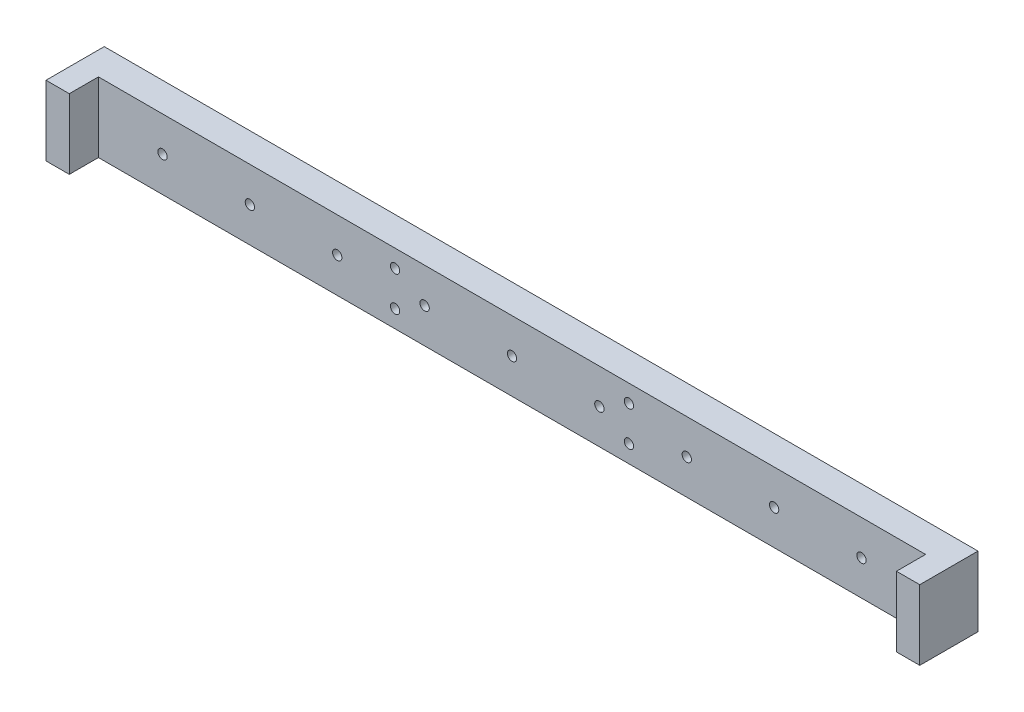
ISO-10303-21;
HEADER;
FILE_DESCRIPTION(('STEP AP214'),'2;1');
FILE_NAME('part.step','',(''),(''),'','','');
FILE_SCHEMA(('AUTOMOTIVE_DESIGN { 1 0 10303 214 1 1 1 1 }'));
ENDSEC;
DATA;
#1=APPLICATION_CONTEXT('core data for automotive mechanical design processes');
#2=APPLICATION_PROTOCOL_DEFINITION('international standard','automotive_design',2000,#1);
#3=PRODUCT_CONTEXT('',#1,'mechanical');
#4=PRODUCT('Part','Part','',(#3));
#5=PRODUCT_RELATED_PRODUCT_CATEGORY('part','',(#4));
#6=PRODUCT_DEFINITION_FORMATION('','',#4);
#7=PRODUCT_DEFINITION_CONTEXT('part definition',#1,'design');
#8=PRODUCT_DEFINITION('design','',#6,#7);
#9=PRODUCT_DEFINITION_SHAPE('','',#8);
#10=(LENGTH_UNIT() NAMED_UNIT(*) SI_UNIT(.MILLI.,.METRE.));
#11=(NAMED_UNIT(*) PLANE_ANGLE_UNIT() SI_UNIT($,.RADIAN.));
#12=(NAMED_UNIT(*) SI_UNIT($,.STERADIAN.) SOLID_ANGLE_UNIT());
#13=UNCERTAINTY_MEASURE_WITH_UNIT(LENGTH_MEASURE(1.E-05),#10,'distance_accuracy_value','');
#14=(GEOMETRIC_REPRESENTATION_CONTEXT(3) GLOBAL_UNCERTAINTY_ASSIGNED_CONTEXT((#13)) GLOBAL_UNIT_ASSIGNED_CONTEXT((#10,
#11,#12)) REPRESENTATION_CONTEXT('',''));
#15=CARTESIAN_POINT('',(0.,0.,0.));
#16=DIRECTION('',(0.,0.,1.));
#17=DIRECTION('',(1.,0.,0.));
#18=AXIS2_PLACEMENT_3D('',#15,#16,#17);
#19=CARTESIAN_POINT('',(-75.,-6.00000000000001,5.));
#20=DIRECTION('',(1.,0.,0.));
#21=DIRECTION('',(0.,0.,-1.));
#22=AXIS2_PLACEMENT_3D('',#19,#20,#21);
#23=PLANE('',#22);
#24=DIRECTION('',(0.,-1.,0.));
#25=VECTOR('',#24,1.);
#26=CARTESIAN_POINT('',(-75.,-6.00000000000001,0.));
#27=LINE('',#26,#25);
#28=CARTESIAN_POINT('',(-75.,5.99999999999999,0.));
#29=VERTEX_POINT('',#28);
#30=CARTESIAN_POINT('',(-75.,-6.00000000000001,0.));
#31=VERTEX_POINT('',#30);
#32=EDGE_CURVE('E177',#29,#31,#27,.T.);
#33=ORIENTED_EDGE('',*,*,#32,.T.);
#34=DIRECTION('',(0.,0.,-1.));
#35=VECTOR('',#34,1.);
#36=CARTESIAN_POINT('',(-75.,-6.00000000000001,5.));
#37=LINE('',#36,#35);
#38=CARTESIAN_POINT('',(-75.,-6.00000000000001,10.));
#39=VERTEX_POINT('',#38);
#40=EDGE_CURVE('E11',#39,#31,#37,.T.);
#41=ORIENTED_EDGE('',*,*,#40,.F.);
#42=DIRECTION('',(0.,-1.,0.));
#43=VECTOR('',#42,1.);
#44=CARTESIAN_POINT('',(-75.,-6.00000000000001,10.));
#45=LINE('',#44,#43);
#46=CARTESIAN_POINT('',(-75.,5.99999999999999,10.));
#47=VERTEX_POINT('',#46);
#48=EDGE_CURVE('E152',#47,#39,#45,.T.);
#49=ORIENTED_EDGE('',*,*,#48,.F.);
#50=DIRECTION('',(0.,0.,-1.));
#51=VECTOR('',#50,1.);
#52=CARTESIAN_POINT('',(-75.,5.99999999999999,5.));
#53=LINE('',#52,#51);
#54=EDGE_CURVE('E119',#47,#29,#53,.T.);
#55=ORIENTED_EDGE('',*,*,#54,.T.);
#56=EDGE_LOOP('',(#33,#41,#49,#55));
#57=FACE_BOUND('',#56,.T.);
#58=ADVANCED_FACE('F43',(#57),#23,.F.);
#59=CARTESIAN_POINT('',(75.,-5.99999999999999,5.));
#60=DIRECTION('',(0.,1.,0.));
#61=DIRECTION('',(-1.,0.,0.));
#62=AXIS2_PLACEMENT_3D('',#59,#60,#61);
#63=PLANE('',#62);
#64=DIRECTION('',(1.,0.,0.));
#65=VECTOR('',#64,1.);
#66=CARTESIAN_POINT('',(75.,-5.99999999999999,0.));
#67=LINE('',#66,#65);
#68=CARTESIAN_POINT('',(75.,-5.99999999999999,0.));
#69=VERTEX_POINT('',#68);
#70=EDGE_CURVE('E187',#31,#69,#67,.T.);
#71=ORIENTED_EDGE('',*,*,#70,.T.);
#72=DIRECTION('',(0.,0.,-1.));
#73=VECTOR('',#72,1.);
#74=CARTESIAN_POINT('',(75.,-5.99999999999999,5.));
#75=LINE('',#74,#73);
#76=CARTESIAN_POINT('',(75.,-6.00000000000001,10.));
#77=VERTEX_POINT('',#76);
#78=EDGE_CURVE('E51',#77,#69,#75,.T.);
#79=ORIENTED_EDGE('',*,*,#78,.F.);
#80=DIRECTION('',(-1.,0.,0.));
#81=VECTOR('',#80,1.);
#82=CARTESIAN_POINT('',(71.,-6.00000000000001,10.));
#83=LINE('',#82,#81);
#84=CARTESIAN_POINT('',(71.,-6.00000000000001,10.));
#85=VERTEX_POINT('',#84);
#86=EDGE_CURVE('E128',#77,#85,#83,.T.);
#87=ORIENTED_EDGE('',*,*,#86,.T.);
#88=DIRECTION('',(0.,0.,-1.));
#89=VECTOR('',#88,1.);
#90=CARTESIAN_POINT('',(71.,-6.00000000000001,10.));
#91=LINE('',#90,#89);
#92=CARTESIAN_POINT('',(71.,-5.99999999999999,5.));
#93=VERTEX_POINT('',#92);
#94=EDGE_CURVE('E143',#85,#93,#91,.T.);
#95=ORIENTED_EDGE('',*,*,#94,.T.);
#96=DIRECTION('',(1.,0.,0.));
#97=VECTOR('',#96,1.);
#98=CARTESIAN_POINT('',(75.,-5.99999999999999,5.));
#99=LINE('',#98,#97);
#100=CARTESIAN_POINT('',(-71.,-6.00000000000001,5.));
#101=VERTEX_POINT('',#100);
#102=EDGE_CURVE('E63',#101,#93,#99,.T.);
#103=ORIENTED_EDGE('',*,*,#102,.F.);
#104=DIRECTION('',(0.,0.,-1.));
#105=VECTOR('',#104,1.);
#106=CARTESIAN_POINT('',(-71.,-6.00000000000001,10.));
#107=LINE('',#106,#105);
#108=CARTESIAN_POINT('',(-71.,-6.00000000000001,10.));
#109=VERTEX_POINT('',#108);
#110=EDGE_CURVE('E173',#109,#101,#107,.T.);
#111=ORIENTED_EDGE('',*,*,#110,.F.);
#112=DIRECTION('',(1.,0.,0.));
#113=VECTOR('',#112,1.);
#114=CARTESIAN_POINT('',(-71.,-6.00000000000001,10.));
#115=LINE('',#114,#113);
#116=EDGE_CURVE('E156',#39,#109,#115,.T.);
#117=ORIENTED_EDGE('',*,*,#116,.F.);
#118=ORIENTED_EDGE('',*,*,#40,.T.);
#119=EDGE_LOOP('',(#71,#79,#87,#95,#103,#111,#117,#118));
#120=FACE_BOUND('',#119,.T.);
#121=ADVANCED_FACE('F213',(#120),#63,.F.);
#122=CARTESIAN_POINT('',(75.,-5.99999999999999,5.));
#123=DIRECTION('',(-1.,0.,0.));
#124=DIRECTION('',(0.,0.,1.));
#125=AXIS2_PLACEMENT_3D('',#122,#123,#124);
#126=PLANE('',#125);
#127=DIRECTION('',(0.,1.,0.));
#128=VECTOR('',#127,1.);
#129=CARTESIAN_POINT('',(75.,-5.99999999999999,0.));
#130=LINE('',#129,#128);
#131=CARTESIAN_POINT('',(75.,6.00000000000001,0.));
#132=VERTEX_POINT('',#131);
#133=EDGE_CURVE('E114',#69,#132,#130,.T.);
#134=ORIENTED_EDGE('',*,*,#133,.T.);
#135=DIRECTION('',(0.,0.,-1.));
#136=VECTOR('',#135,1.);
#137=CARTESIAN_POINT('',(75.,6.00000000000001,5.));
#138=LINE('',#137,#136);
#139=CARTESIAN_POINT('',(75.,5.99999999999999,10.));
#140=VERTEX_POINT('',#139);
#141=EDGE_CURVE('E107',#140,#132,#138,.T.);
#142=ORIENTED_EDGE('',*,*,#141,.F.);
#143=DIRECTION('',(0.,-1.,0.));
#144=VECTOR('',#143,1.);
#145=CARTESIAN_POINT('',(75.,-6.00000000000001,10.));
#146=LINE('',#145,#144);
#147=EDGE_CURVE('E111',#140,#77,#146,.T.);
#148=ORIENTED_EDGE('',*,*,#147,.T.);
#149=ORIENTED_EDGE('',*,*,#78,.T.);
#150=EDGE_LOOP('',(#134,#142,#148,#149));
#151=FACE_BOUND('',#150,.T.);
#152=ADVANCED_FACE('F109',(#151),#126,.F.);
#153=CARTESIAN_POINT('',(75.,6.00000000000001,5.));
#154=DIRECTION('',(0.,-1.,0.));
#155=DIRECTION('',(1.,0.,0.));
#156=AXIS2_PLACEMENT_3D('',#153,#154,#155);
#157=PLANE('',#156);
#158=DIRECTION('',(-1.,0.,0.));
#159=VECTOR('',#158,1.);
#160=CARTESIAN_POINT('',(75.,6.00000000000001,0.));
#161=LINE('',#160,#159);
#162=EDGE_CURVE('E181',#132,#29,#161,.T.);
#163=ORIENTED_EDGE('',*,*,#162,.T.);
#164=ORIENTED_EDGE('',*,*,#54,.F.);
#165=DIRECTION('',(-1.,0.,0.));
#166=VECTOR('',#165,1.);
#167=CARTESIAN_POINT('',(-75.,5.99999999999999,10.));
#168=LINE('',#167,#166);
#169=CARTESIAN_POINT('',(-71.,6.00000000000001,10.));
#170=VERTEX_POINT('',#169);
#171=EDGE_CURVE('E162',#170,#47,#168,.T.);
#172=ORIENTED_EDGE('',*,*,#171,.F.);
#173=DIRECTION('',(0.,0.,-1.));
#174=VECTOR('',#173,1.);
#175=CARTESIAN_POINT('',(-71.,6.00000000000001,10.));
#176=LINE('',#175,#174);
#177=CARTESIAN_POINT('',(-71.,6.00000000000001,5.));
#178=VERTEX_POINT('',#177);
#179=EDGE_CURVE('E166',#170,#178,#176,.T.);
#180=ORIENTED_EDGE('',*,*,#179,.T.);
#181=DIRECTION('',(-1.,0.,0.));
#182=VECTOR('',#181,1.);
#183=CARTESIAN_POINT('',(75.,6.00000000000001,5.));
#184=LINE('',#183,#182);
#185=CARTESIAN_POINT('',(71.,6.00000000000001,5.));
#186=VERTEX_POINT('',#185);
#187=EDGE_CURVE('E180',#186,#178,#184,.T.);
#188=ORIENTED_EDGE('',*,*,#187,.F.);
#189=DIRECTION('',(0.,0.,-1.));
#190=VECTOR('',#189,1.);
#191=CARTESIAN_POINT('',(71.,6.00000000000001,10.));
#192=LINE('',#191,#190);
#193=CARTESIAN_POINT('',(71.,6.00000000000001,10.));
#194=VERTEX_POINT('',#193);
#195=EDGE_CURVE('E133',#194,#186,#192,.T.);
#196=ORIENTED_EDGE('',*,*,#195,.F.);
#197=DIRECTION('',(1.,0.,0.));
#198=VECTOR('',#197,1.);
#199=CARTESIAN_POINT('',(75.,5.99999999999999,10.));
#200=LINE('',#199,#198);
#201=EDGE_CURVE('E125',#194,#140,#200,.T.);
#202=ORIENTED_EDGE('',*,*,#201,.T.);
#203=ORIENTED_EDGE('',*,*,#141,.T.);
#204=EDGE_LOOP('',(#163,#164,#172,#180,#188,#196,#202,#203));
#205=FACE_BOUND('',#204,.T.);
#206=ADVANCED_FACE('F131',(#205),#157,.F.);
#207=CARTESIAN_POINT('',(0.,0.,5.));
#208=DIRECTION('',(0.,0.,1.));
#209=DIRECTION('',(1.,0.,0.));
#210=AXIS2_PLACEMENT_3D('',#207,#208,#209);
#211=PLANE('',#210);
#212=CARTESIAN_POINT('',(15.,0.,5.));
#213=DIRECTION('',(0.,0.,1.));
#214=DIRECTION('',(1.,0.,0.));
#215=AXIS2_PLACEMENT_3D('',#212,#213,#214);
#216=CIRCLE('',#215,0.799999999999988);
#217=CARTESIAN_POINT('',(15.8,0.,5.));
#218=VERTEX_POINT('',#217);
#219=EDGE_CURVE('E466',#218,#218,#216,.T.);
#220=ORIENTED_EDGE('',*,*,#219,.F.);
#221=EDGE_LOOP('',(#220));
#222=FACE_BOUND('',#221,.T.);
#223=CARTESIAN_POINT('',(30.,0.,5.));
#224=DIRECTION('',(0.,0.,1.));
#225=DIRECTION('',(1.,0.,0.));
#226=AXIS2_PLACEMENT_3D('',#223,#224,#225);
#227=CIRCLE('',#226,0.799999999999988);
#228=CARTESIAN_POINT('',(30.8,0.,5.));
#229=VERTEX_POINT('',#228);
#230=EDGE_CURVE('E470',#229,#229,#227,.T.);
#231=ORIENTED_EDGE('',*,*,#230,.F.);
#232=EDGE_LOOP('',(#231));
#233=FACE_BOUND('',#232,.T.);
#234=CARTESIAN_POINT('',(-30.,0.,5.));
#235=DIRECTION('',(0.,0.,1.));
#236=DIRECTION('',(1.,0.,0.));
#237=AXIS2_PLACEMENT_3D('',#234,#235,#236);
#238=CIRCLE('',#237,0.799999999999988);
#239=CARTESIAN_POINT('',(-29.2,0.,5.));
#240=VERTEX_POINT('',#239);
#241=EDGE_CURVE('E480',#240,#240,#238,.T.);
#242=ORIENTED_EDGE('',*,*,#241,.F.);
#243=EDGE_LOOP('',(#242));
#244=FACE_BOUND('',#243,.T.);
#245=CARTESIAN_POINT('',(-45.,0.,5.));
#246=DIRECTION('',(0.,0.,1.));
#247=DIRECTION('',(1.,0.,0.));
#248=AXIS2_PLACEMENT_3D('',#245,#246,#247);
#249=CIRCLE('',#248,0.799999999999988);
#250=CARTESIAN_POINT('',(-44.2,0.,5.));
#251=VERTEX_POINT('',#250);
#252=EDGE_CURVE('E488',#251,#251,#249,.T.);
#253=ORIENTED_EDGE('',*,*,#252,.F.);
#254=EDGE_LOOP('',(#253));
#255=FACE_BOUND('',#254,.T.);
#256=CARTESIAN_POINT('',(-60.,0.,5.));
#257=DIRECTION('',(0.,0.,1.));
#258=DIRECTION('',(1.,0.,0.));
#259=AXIS2_PLACEMENT_3D('',#256,#257,#258);
#260=CIRCLE('',#259,0.799999999999988);
#261=CARTESIAN_POINT('',(-59.2,0.,5.));
#262=VERTEX_POINT('',#261);
#263=EDGE_CURVE('E496',#262,#262,#260,.T.);
#264=ORIENTED_EDGE('',*,*,#263,.F.);
#265=EDGE_LOOP('',(#264));
#266=FACE_BOUND('',#265,.T.);
#267=CARTESIAN_POINT('',(-15.,0.,5.));
#268=DIRECTION('',(0.,0.,1.));
#269=DIRECTION('',(1.,0.,0.));
#270=AXIS2_PLACEMENT_3D('',#267,#268,#269);
#271=CIRCLE('',#270,0.799999999999988);
#272=CARTESIAN_POINT('',(-14.2,0.,5.));
#273=VERTEX_POINT('',#272);
#274=EDGE_CURVE('E504',#273,#273,#271,.T.);
#275=ORIENTED_EDGE('',*,*,#274,.F.);
#276=EDGE_LOOP('',(#275));
#277=FACE_BOUND('',#276,.T.);
#278=CARTESIAN_POINT('',(45.,0.,5.));
#279=DIRECTION('',(0.,0.,1.));
#280=DIRECTION('',(1.,0.,0.));
#281=AXIS2_PLACEMENT_3D('',#278,#279,#280);
#282=CIRCLE('',#281,0.799999999999988);
#283=CARTESIAN_POINT('',(45.8,0.,5.));
#284=VERTEX_POINT('',#283);
#285=EDGE_CURVE('E512',#284,#284,#282,.T.);
#286=ORIENTED_EDGE('',*,*,#285,.F.);
#287=EDGE_LOOP('',(#286));
#288=FACE_BOUND('',#287,.T.);
#289=CARTESIAN_POINT('',(60.,0.,5.));
#290=DIRECTION('',(0.,0.,1.));
#291=DIRECTION('',(1.,0.,0.));
#292=AXIS2_PLACEMENT_3D('',#289,#290,#291);
#293=CIRCLE('',#292,0.799999999999988);
#294=CARTESIAN_POINT('',(60.8,0.,5.));
#295=VERTEX_POINT('',#294);
#296=EDGE_CURVE('E520',#295,#295,#293,.T.);
#297=ORIENTED_EDGE('',*,*,#296,.F.);
#298=EDGE_LOOP('',(#297));
#299=FACE_BOUND('',#298,.T.);
#300=CARTESIAN_POINT('',(0.,0.,5.));
#301=DIRECTION('',(0.,0.,1.));
#302=DIRECTION('',(1.,0.,0.));
#303=AXIS2_PLACEMENT_3D('',#300,#301,#302);
#304=CIRCLE('',#303,0.799999999999998);
#305=CARTESIAN_POINT('',(0.799999999999998,0.,5.));
#306=VERTEX_POINT('',#305);
#307=EDGE_CURVE('E532',#306,#306,#304,.T.);
#308=ORIENTED_EDGE('',*,*,#307,.F.);
#309=EDGE_LOOP('',(#308));
#310=FACE_BOUND('',#309,.T.);
#311=CARTESIAN_POINT('',(20.075,-3.,5.));
#312=DIRECTION('',(0.,0.,1.));
#313=DIRECTION('',(1.,0.,0.));
#314=AXIS2_PLACEMENT_3D('',#311,#312,#313);
#315=CIRCLE('',#314,0.799999999999999);
#316=CARTESIAN_POINT('',(20.875,-3.,5.));
#317=VERTEX_POINT('',#316);
#318=EDGE_CURVE('E540',#317,#317,#315,.T.);
#319=ORIENTED_EDGE('',*,*,#318,.F.);
#320=EDGE_LOOP('',(#319));
#321=FACE_BOUND('',#320,.T.);
#322=CARTESIAN_POINT('',(20.075,3.,5.));
#323=DIRECTION('',(0.,0.,1.));
#324=DIRECTION('',(1.,0.,0.));
#325=AXIS2_PLACEMENT_3D('',#322,#323,#324);
#326=CIRCLE('',#325,0.799999999999999);
#327=CARTESIAN_POINT('',(20.875,3.,5.));
#328=VERTEX_POINT('',#327);
#329=EDGE_CURVE('E548',#328,#328,#326,.T.);
#330=ORIENTED_EDGE('',*,*,#329,.F.);
#331=EDGE_LOOP('',(#330));
#332=FACE_BOUND('',#331,.T.);
#333=CARTESIAN_POINT('',(-20.075,-2.99999999999994,5.));
#334=DIRECTION('',(0.,0.,1.));
#335=DIRECTION('',(1.,0.,0.));
#336=AXIS2_PLACEMENT_3D('',#333,#334,#335);
#337=CIRCLE('',#336,0.799999999999999);
#338=CARTESIAN_POINT('',(-19.275,-2.99999999999994,5.));
#339=VERTEX_POINT('',#338);
#340=EDGE_CURVE('E556',#339,#339,#337,.T.);
#341=ORIENTED_EDGE('',*,*,#340,.F.);
#342=EDGE_LOOP('',(#341));
#343=FACE_BOUND('',#342,.T.);
#344=CARTESIAN_POINT('',(-20.075,3.00000000000007,5.));
#345=DIRECTION('',(0.,0.,1.));
#346=DIRECTION('',(1.,0.,0.));
#347=AXIS2_PLACEMENT_3D('',#344,#345,#346);
#348=CIRCLE('',#347,0.799999999999999);
#349=CARTESIAN_POINT('',(-19.275,3.00000000000007,5.));
#350=VERTEX_POINT('',#349);
#351=EDGE_CURVE('E146',#350,#350,#348,.T.);
#352=ORIENTED_EDGE('',*,*,#351,.F.);
#353=EDGE_LOOP('',(#352));
#354=FACE_BOUND('',#353,.T.);
#355=DIRECTION('',(0.,1.,0.));
#356=VECTOR('',#355,1.);
#357=CARTESIAN_POINT('',(71.,6.00000000000001,5.));
#358=LINE('',#357,#356);
#359=EDGE_CURVE('E58',#93,#186,#358,.T.);
#360=ORIENTED_EDGE('',*,*,#359,.T.);
#361=ORIENTED_EDGE('',*,*,#187,.T.);
#362=DIRECTION('',(0.,1.,0.));
#363=VECTOR('',#362,1.);
#364=CARTESIAN_POINT('',(-71.,6.00000000000001,5.));
#365=LINE('',#364,#363);
#366=EDGE_CURVE('E151',#101,#178,#365,.T.);
#367=ORIENTED_EDGE('',*,*,#366,.F.);
#368=ORIENTED_EDGE('',*,*,#102,.T.);
#369=EDGE_LOOP('',(#360,#361,#367,#368));
#370=FACE_BOUND('',#369,.T.);
#371=ADVANCED_FACE('F212',(#222,#233,#244,#255,#266,#277,#288,#299,#310,#321,#332,#343,#354,
#370),#211,.T.);
#372=CARTESIAN_POINT('',(0.,0.,0.));
#373=DIRECTION('',(0.,0.,1.));
#374=DIRECTION('',(1.,0.,0.));
#375=AXIS2_PLACEMENT_3D('',#372,#373,#374);
#376=PLANE('',#375);
#377=CARTESIAN_POINT('',(15.,0.,0.));
#378=DIRECTION('',(0.,0.,1.));
#379=DIRECTION('',(1.,0.,0.));
#380=AXIS2_PLACEMENT_3D('',#377,#378,#379);
#381=CIRCLE('',#380,0.799999999999999);
#382=CARTESIAN_POINT('',(15.8,0.,0.));
#383=VERTEX_POINT('',#382);
#384=EDGE_CURVE('E463',#383,#383,#381,.T.);
#385=ORIENTED_EDGE('',*,*,#384,.T.);
#386=EDGE_LOOP('',(#385));
#387=FACE_BOUND('',#386,.T.);
#388=CARTESIAN_POINT('',(30.,0.,0.));
#389=DIRECTION('',(0.,0.,1.));
#390=DIRECTION('',(1.,0.,0.));
#391=AXIS2_PLACEMENT_3D('',#388,#389,#390);
#392=CIRCLE('',#391,0.799999999999999);
#393=CARTESIAN_POINT('',(30.8,0.,0.));
#394=VERTEX_POINT('',#393);
#395=EDGE_CURVE('E476',#394,#394,#392,.T.);
#396=ORIENTED_EDGE('',*,*,#395,.T.);
#397=EDGE_LOOP('',(#396));
#398=FACE_BOUND('',#397,.T.);
#399=CARTESIAN_POINT('',(-30.,0.,0.));
#400=DIRECTION('',(0.,0.,1.));
#401=DIRECTION('',(1.,0.,0.));
#402=AXIS2_PLACEMENT_3D('',#399,#400,#401);
#403=CIRCLE('',#402,0.799999999999999);
#404=CARTESIAN_POINT('',(-29.2,0.,0.));
#405=VERTEX_POINT('',#404);
#406=EDGE_CURVE('E484',#405,#405,#403,.T.);
#407=ORIENTED_EDGE('',*,*,#406,.T.);
#408=EDGE_LOOP('',(#407));
#409=FACE_BOUND('',#408,.T.);
#410=CARTESIAN_POINT('',(-45.,0.,0.));
#411=DIRECTION('',(0.,0.,1.));
#412=DIRECTION('',(1.,0.,0.));
#413=AXIS2_PLACEMENT_3D('',#410,#411,#412);
#414=CIRCLE('',#413,0.800000000000002);
#415=CARTESIAN_POINT('',(-44.2,0.,0.));
#416=VERTEX_POINT('',#415);
#417=EDGE_CURVE('E492',#416,#416,#414,.T.);
#418=ORIENTED_EDGE('',*,*,#417,.T.);
#419=EDGE_LOOP('',(#418));
#420=FACE_BOUND('',#419,.T.);
#421=CARTESIAN_POINT('',(-60.,0.,0.));
#422=DIRECTION('',(0.,0.,1.));
#423=DIRECTION('',(1.,0.,0.));
#424=AXIS2_PLACEMENT_3D('',#421,#422,#423);
#425=CIRCLE('',#424,0.800000000000002);
#426=CARTESIAN_POINT('',(-59.2,0.,0.));
#427=VERTEX_POINT('',#426);
#428=EDGE_CURVE('E500',#427,#427,#425,.T.);
#429=ORIENTED_EDGE('',*,*,#428,.T.);
#430=EDGE_LOOP('',(#429));
#431=FACE_BOUND('',#430,.T.);
#432=CARTESIAN_POINT('',(-15.,0.,0.));
#433=DIRECTION('',(0.,0.,1.));
#434=DIRECTION('',(1.,0.,0.));
#435=AXIS2_PLACEMENT_3D('',#432,#433,#434);
#436=CIRCLE('',#435,0.799999999999999);
#437=CARTESIAN_POINT('',(-14.2,0.,0.));
#438=VERTEX_POINT('',#437);
#439=EDGE_CURVE('E508',#438,#438,#436,.T.);
#440=ORIENTED_EDGE('',*,*,#439,.T.);
#441=EDGE_LOOP('',(#440));
#442=FACE_BOUND('',#441,.T.);
#443=CARTESIAN_POINT('',(45.,0.,0.));
#444=DIRECTION('',(0.,0.,1.));
#445=DIRECTION('',(1.,0.,0.));
#446=AXIS2_PLACEMENT_3D('',#443,#444,#445);
#447=CIRCLE('',#446,0.800000000000002);
#448=CARTESIAN_POINT('',(45.8,0.,0.));
#449=VERTEX_POINT('',#448);
#450=EDGE_CURVE('E516',#449,#449,#447,.T.);
#451=ORIENTED_EDGE('',*,*,#450,.T.);
#452=EDGE_LOOP('',(#451));
#453=FACE_BOUND('',#452,.T.);
#454=CARTESIAN_POINT('',(60.,0.,0.));
#455=DIRECTION('',(0.,0.,1.));
#456=DIRECTION('',(1.,0.,0.));
#457=AXIS2_PLACEMENT_3D('',#454,#455,#456);
#458=CIRCLE('',#457,0.800000000000002);
#459=CARTESIAN_POINT('',(60.8,0.,0.));
#460=VERTEX_POINT('',#459);
#461=EDGE_CURVE('E524',#460,#460,#458,.T.);
#462=ORIENTED_EDGE('',*,*,#461,.T.);
#463=EDGE_LOOP('',(#462));
#464=FACE_BOUND('',#463,.T.);
#465=CARTESIAN_POINT('',(0.,0.,0.));
#466=DIRECTION('',(0.,0.,-1.));
#467=DIRECTION('',(-1.,0.,0.));
#468=AXIS2_PLACEMENT_3D('',#465,#466,#467);
#469=CIRCLE('',#468,0.799999999999999);
#470=CARTESIAN_POINT('',(-0.799999999999999,0.,0.));
#471=VERTEX_POINT('',#470);
#472=EDGE_CURVE('E528',#471,#471,#469,.T.);
#473=ORIENTED_EDGE('',*,*,#472,.F.);
#474=EDGE_LOOP('',(#473));
#475=FACE_BOUND('',#474,.T.);
#476=CARTESIAN_POINT('',(20.075,-3.,0.));
#477=DIRECTION('',(0.,0.,-1.));
#478=DIRECTION('',(-1.,0.,0.));
#479=AXIS2_PLACEMENT_3D('',#476,#477,#478);
#480=CIRCLE('',#479,0.799999999999999);
#481=CARTESIAN_POINT('',(19.275,-3.,0.));
#482=VERTEX_POINT('',#481);
#483=EDGE_CURVE('E536',#482,#482,#480,.T.);
#484=ORIENTED_EDGE('',*,*,#483,.F.);
#485=EDGE_LOOP('',(#484));
#486=FACE_BOUND('',#485,.T.);
#487=CARTESIAN_POINT('',(20.075,3.,0.));
#488=DIRECTION('',(0.,0.,-1.));
#489=DIRECTION('',(-1.,0.,0.));
#490=AXIS2_PLACEMENT_3D('',#487,#488,#489);
#491=CIRCLE('',#490,0.799999999999999);
#492=CARTESIAN_POINT('',(19.275,3.,0.));
#493=VERTEX_POINT('',#492);
#494=EDGE_CURVE('E544',#493,#493,#491,.T.);
#495=ORIENTED_EDGE('',*,*,#494,.F.);
#496=EDGE_LOOP('',(#495));
#497=FACE_BOUND('',#496,.T.);
#498=CARTESIAN_POINT('',(-20.075,-2.99999999999994,0.));
#499=DIRECTION('',(0.,0.,-1.));
#500=DIRECTION('',(-1.,0.,0.));
#501=AXIS2_PLACEMENT_3D('',#498,#499,#500);
#502=CIRCLE('',#501,0.799999999999999);
#503=CARTESIAN_POINT('',(-20.875,-2.99999999999994,0.));
#504=VERTEX_POINT('',#503);
#505=EDGE_CURVE('E552',#504,#504,#502,.T.);
#506=ORIENTED_EDGE('',*,*,#505,.F.);
#507=EDGE_LOOP('',(#506));
#508=FACE_BOUND('',#507,.T.);
#509=CARTESIAN_POINT('',(-20.075,3.00000000000007,0.));
#510=DIRECTION('',(0.,0.,-1.));
#511=DIRECTION('',(-1.,0.,0.));
#512=AXIS2_PLACEMENT_3D('',#509,#510,#511);
#513=CIRCLE('',#512,0.799999999999999);
#514=CARTESIAN_POINT('',(-20.875,3.00000000000007,0.));
#515=VERTEX_POINT('',#514);
#516=EDGE_CURVE('E560',#515,#515,#513,.T.);
#517=ORIENTED_EDGE('',*,*,#516,.F.);
#518=EDGE_LOOP('',(#517));
#519=FACE_BOUND('',#518,.T.);
#520=ORIENTED_EDGE('',*,*,#32,.F.);
#521=ORIENTED_EDGE('',*,*,#162,.F.);
#522=ORIENTED_EDGE('',*,*,#133,.F.);
#523=ORIENTED_EDGE('',*,*,#70,.F.);
#524=EDGE_LOOP('',(#520,#521,#522,#523));
#525=FACE_BOUND('',#524,.T.);
#526=ADVANCED_FACE('F200',(#387,#398,#409,#420,#431,#442,#453,#464,#475,#486,#497,#508,#519,
#525),#376,.F.);
#527=CARTESIAN_POINT('',(-71.,6.00000000000001,10.));
#528=DIRECTION('',(-1.,0.,0.));
#529=DIRECTION('',(0.,0.,1.));
#530=AXIS2_PLACEMENT_3D('',#527,#528,#529);
#531=PLANE('',#530);
#532=ORIENTED_EDGE('',*,*,#366,.T.);
#533=ORIENTED_EDGE('',*,*,#179,.F.);
#534=DIRECTION('',(0.,1.,0.));
#535=VECTOR('',#534,1.);
#536=CARTESIAN_POINT('',(-71.,6.00000000000001,10.));
#537=LINE('',#536,#535);
#538=EDGE_CURVE('E159',#109,#170,#537,.T.);
#539=ORIENTED_EDGE('',*,*,#538,.F.);
#540=ORIENTED_EDGE('',*,*,#110,.T.);
#541=EDGE_LOOP('',(#532,#533,#539,#540));
#542=FACE_BOUND('',#541,.T.);
#543=ADVANCED_FACE('F211',(#542),#531,.F.);
#544=CARTESIAN_POINT('',(0.,0.,10.));
#545=DIRECTION('',(0.,0.,-1.));
#546=DIRECTION('',(-1.,0.,0.));
#547=AXIS2_PLACEMENT_3D('',#544,#545,#546);
#548=PLANE('',#547);
#549=ORIENTED_EDGE('',*,*,#48,.T.);
#550=ORIENTED_EDGE('',*,*,#116,.T.);
#551=ORIENTED_EDGE('',*,*,#538,.T.);
#552=ORIENTED_EDGE('',*,*,#171,.T.);
#553=EDGE_LOOP('',(#549,#550,#551,#552));
#554=FACE_BOUND('',#553,.T.);
#555=ADVANCED_FACE('F206',(#554),#548,.F.);
#556=CARTESIAN_POINT('',(71.,6.00000000000001,10.));
#557=DIRECTION('',(-1.,0.,0.));
#558=DIRECTION('',(0.,0.,1.));
#559=AXIS2_PLACEMENT_3D('',#556,#557,#558);
#560=PLANE('',#559);
#561=ORIENTED_EDGE('',*,*,#359,.F.);
#562=ORIENTED_EDGE('',*,*,#94,.F.);
#563=DIRECTION('',(0.,1.,0.));
#564=VECTOR('',#563,1.);
#565=CARTESIAN_POINT('',(71.,6.00000000000001,10.));
#566=LINE('',#565,#564);
#567=EDGE_CURVE('E135',#85,#194,#566,.T.);
#568=ORIENTED_EDGE('',*,*,#567,.T.);
#569=ORIENTED_EDGE('',*,*,#195,.T.);
#570=EDGE_LOOP('',(#561,#562,#568,#569));
#571=FACE_BOUND('',#570,.T.);
#572=ADVANCED_FACE('F215',(#571),#560,.T.);
#573=CARTESIAN_POINT('',(0.,0.,10.));
#574=DIRECTION('',(0.,0.,-1.));
#575=DIRECTION('',(1.,0.,0.));
#576=AXIS2_PLACEMENT_3D('',#573,#574,#575);
#577=PLANE('',#576);
#578=ORIENTED_EDGE('',*,*,#147,.F.);
#579=ORIENTED_EDGE('',*,*,#201,.F.);
#580=ORIENTED_EDGE('',*,*,#567,.F.);
#581=ORIENTED_EDGE('',*,*,#86,.F.);
#582=EDGE_LOOP('',(#578,#579,#580,#581));
#583=FACE_BOUND('',#582,.T.);
#584=ADVANCED_FACE('F123',(#583),#577,.F.);
#585=CARTESIAN_POINT('',(-20.075,3.00000000000007,0.));
#586=DIRECTION('',(0.,0.,-1.));
#587=DIRECTION('',(-1.,0.,0.));
#588=AXIS2_PLACEMENT_3D('',#585,#586,#587);
#589=CYLINDRICAL_SURFACE('',#588,0.799999999999999);
#590=ORIENTED_EDGE('',*,*,#351,.T.);
#591=EDGE_LOOP('',(#590));
#592=FACE_BOUND('',#591,.T.);
#593=ORIENTED_EDGE('',*,*,#516,.T.);
#594=EDGE_LOOP('',(#593));
#595=FACE_BOUND('',#594,.T.);
#596=ADVANCED_FACE('F222',(#592,#595),#589,.F.);
#597=CARTESIAN_POINT('',(-20.075,-2.99999999999994,0.));
#598=DIRECTION('',(0.,0.,-1.));
#599=DIRECTION('',(-1.,0.,0.));
#600=AXIS2_PLACEMENT_3D('',#597,#598,#599);
#601=CYLINDRICAL_SURFACE('',#600,0.799999999999999);
#602=ORIENTED_EDGE('',*,*,#340,.T.);
#603=EDGE_LOOP('',(#602));
#604=FACE_BOUND('',#603,.T.);
#605=ORIENTED_EDGE('',*,*,#505,.T.);
#606=EDGE_LOOP('',(#605));
#607=FACE_BOUND('',#606,.T.);
#608=ADVANCED_FACE('F290',(#604,#607),#601,.F.);
#609=CARTESIAN_POINT('',(20.075,3.,0.));
#610=DIRECTION('',(0.,0.,-1.));
#611=DIRECTION('',(-1.,0.,0.));
#612=AXIS2_PLACEMENT_3D('',#609,#610,#611);
#613=CYLINDRICAL_SURFACE('',#612,0.799999999999999);
#614=ORIENTED_EDGE('',*,*,#329,.T.);
#615=EDGE_LOOP('',(#614));
#616=FACE_BOUND('',#615,.T.);
#617=ORIENTED_EDGE('',*,*,#494,.T.);
#618=EDGE_LOOP('',(#617));
#619=FACE_BOUND('',#618,.T.);
#620=ADVANCED_FACE('F303',(#616,#619),#613,.F.);
#621=CARTESIAN_POINT('',(20.075,-3.,0.));
#622=DIRECTION('',(0.,0.,-1.));
#623=DIRECTION('',(-1.,0.,0.));
#624=AXIS2_PLACEMENT_3D('',#621,#622,#623);
#625=CYLINDRICAL_SURFACE('',#624,0.799999999999999);
#626=ORIENTED_EDGE('',*,*,#318,.T.);
#627=EDGE_LOOP('',(#626));
#628=FACE_BOUND('',#627,.T.);
#629=ORIENTED_EDGE('',*,*,#483,.T.);
#630=EDGE_LOOP('',(#629));
#631=FACE_BOUND('',#630,.T.);
#632=ADVANCED_FACE('F315',(#628,#631),#625,.F.);
#633=CARTESIAN_POINT('',(0.,0.,0.));
#634=DIRECTION('',(0.,0.,-1.));
#635=DIRECTION('',(-1.,0.,0.));
#636=AXIS2_PLACEMENT_3D('',#633,#634,#635);
#637=CYLINDRICAL_SURFACE('',#636,0.799999999999998);
#638=ORIENTED_EDGE('',*,*,#307,.T.);
#639=EDGE_LOOP('',(#638));
#640=FACE_BOUND('',#639,.T.);
#641=ORIENTED_EDGE('',*,*,#472,.T.);
#642=EDGE_LOOP('',(#641));
#643=FACE_BOUND('',#642,.T.);
#644=ADVANCED_FACE('F327',(#640,#643),#637,.F.);
#645=CARTESIAN_POINT('',(60.,0.,5.));
#646=DIRECTION('',(0.,0.,1.));
#647=DIRECTION('',(1.,0.,0.));
#648=AXIS2_PLACEMENT_3D('',#645,#646,#647);
#649=CYLINDRICAL_SURFACE('',#648,0.799999999999995);
#650=ORIENTED_EDGE('',*,*,#461,.F.);
#651=EDGE_LOOP('',(#650));
#652=FACE_BOUND('',#651,.T.);
#653=ORIENTED_EDGE('',*,*,#296,.T.);
#654=EDGE_LOOP('',(#653));
#655=FACE_BOUND('',#654,.T.);
#656=ADVANCED_FACE('F339',(#652,#655),#649,.F.);
#657=CARTESIAN_POINT('',(45.,0.,5.));
#658=DIRECTION('',(0.,0.,1.));
#659=DIRECTION('',(1.,0.,0.));
#660=AXIS2_PLACEMENT_3D('',#657,#658,#659);
#661=CYLINDRICAL_SURFACE('',#660,0.799999999999995);
#662=ORIENTED_EDGE('',*,*,#450,.F.);
#663=EDGE_LOOP('',(#662));
#664=FACE_BOUND('',#663,.T.);
#665=ORIENTED_EDGE('',*,*,#285,.T.);
#666=EDGE_LOOP('',(#665));
#667=FACE_BOUND('',#666,.T.);
#668=ADVANCED_FACE('F363',(#664,#667),#661,.F.);
#669=CARTESIAN_POINT('',(-15.,0.,5.));
#670=DIRECTION('',(0.,0.,1.));
#671=DIRECTION('',(1.,0.,0.));
#672=AXIS2_PLACEMENT_3D('',#669,#670,#671);
#673=CYLINDRICAL_SURFACE('',#672,0.799999999999993);
#674=ORIENTED_EDGE('',*,*,#439,.F.);
#675=EDGE_LOOP('',(#674));
#676=FACE_BOUND('',#675,.T.);
#677=ORIENTED_EDGE('',*,*,#274,.T.);
#678=EDGE_LOOP('',(#677));
#679=FACE_BOUND('',#678,.T.);
#680=ADVANCED_FACE('F375',(#676,#679),#673,.F.);
#681=CARTESIAN_POINT('',(-60.,0.,5.));
#682=DIRECTION('',(0.,0.,1.));
#683=DIRECTION('',(1.,0.,0.));
#684=AXIS2_PLACEMENT_3D('',#681,#682,#683);
#685=CYLINDRICAL_SURFACE('',#684,0.799999999999995);
#686=ORIENTED_EDGE('',*,*,#428,.F.);
#687=EDGE_LOOP('',(#686));
#688=FACE_BOUND('',#687,.T.);
#689=ORIENTED_EDGE('',*,*,#263,.T.);
#690=EDGE_LOOP('',(#689));
#691=FACE_BOUND('',#690,.T.);
#692=ADVANCED_FACE('F386',(#688,#691),#685,.F.);
#693=CARTESIAN_POINT('',(-45.,0.,5.));
#694=DIRECTION('',(0.,0.,1.));
#695=DIRECTION('',(1.,0.,0.));
#696=AXIS2_PLACEMENT_3D('',#693,#694,#695);
#697=CYLINDRICAL_SURFACE('',#696,0.799999999999995);
#698=ORIENTED_EDGE('',*,*,#417,.F.);
#699=EDGE_LOOP('',(#698));
#700=FACE_BOUND('',#699,.T.);
#701=ORIENTED_EDGE('',*,*,#252,.T.);
#702=EDGE_LOOP('',(#701));
#703=FACE_BOUND('',#702,.T.);
#704=ADVANCED_FACE('F396',(#700,#703),#697,.F.);
#705=CARTESIAN_POINT('',(-30.,0.,5.));
#706=DIRECTION('',(0.,0.,1.));
#707=DIRECTION('',(1.,0.,0.));
#708=AXIS2_PLACEMENT_3D('',#705,#706,#707);
#709=CYLINDRICAL_SURFACE('',#708,0.799999999999993);
#710=ORIENTED_EDGE('',*,*,#406,.F.);
#711=EDGE_LOOP('',(#710));
#712=FACE_BOUND('',#711,.T.);
#713=ORIENTED_EDGE('',*,*,#241,.T.);
#714=EDGE_LOOP('',(#713));
#715=FACE_BOUND('',#714,.T.);
#716=ADVANCED_FACE('F407',(#712,#715),#709,.F.);
#717=CARTESIAN_POINT('',(30.,0.,5.));
#718=DIRECTION('',(0.,0.,1.));
#719=DIRECTION('',(1.,0.,0.));
#720=AXIS2_PLACEMENT_3D('',#717,#718,#719);
#721=CYLINDRICAL_SURFACE('',#720,0.799999999999993);
#722=ORIENTED_EDGE('',*,*,#395,.F.);
#723=EDGE_LOOP('',(#722));
#724=FACE_BOUND('',#723,.T.);
#725=ORIENTED_EDGE('',*,*,#230,.T.);
#726=EDGE_LOOP('',(#725));
#727=FACE_BOUND('',#726,.T.);
#728=ADVANCED_FACE('F418',(#724,#727),#721,.F.);
#729=CARTESIAN_POINT('',(15.,0.,5.));
#730=DIRECTION('',(0.,0.,1.));
#731=DIRECTION('',(1.,0.,0.));
#732=AXIS2_PLACEMENT_3D('',#729,#730,#731);
#733=CYLINDRICAL_SURFACE('',#732,0.799999999999993);
#734=ORIENTED_EDGE('',*,*,#384,.F.);
#735=EDGE_LOOP('',(#734));
#736=FACE_BOUND('',#735,.T.);
#737=ORIENTED_EDGE('',*,*,#219,.T.);
#738=EDGE_LOOP('',(#737));
#739=FACE_BOUND('',#738,.T.);
#740=ADVANCED_FACE('F429',(#736,#739),#733,.F.);
#741=CLOSED_SHELL('',(#58,#121,#152,#206,#371,#526,#543,#555,#572,#584,#596,#608,#620,#632,#644,
#656,#668,#680,#692,#704,#716,#728,#740));
#742=MANIFOLD_SOLID_BREP('B2',#741);
#743=ADVANCED_BREP_SHAPE_REPRESENTATION('',(#18,#742),#14);
#744=SHAPE_DEFINITION_REPRESENTATION(#9,#743);
ENDSEC;
END-ISO-10303-21;
